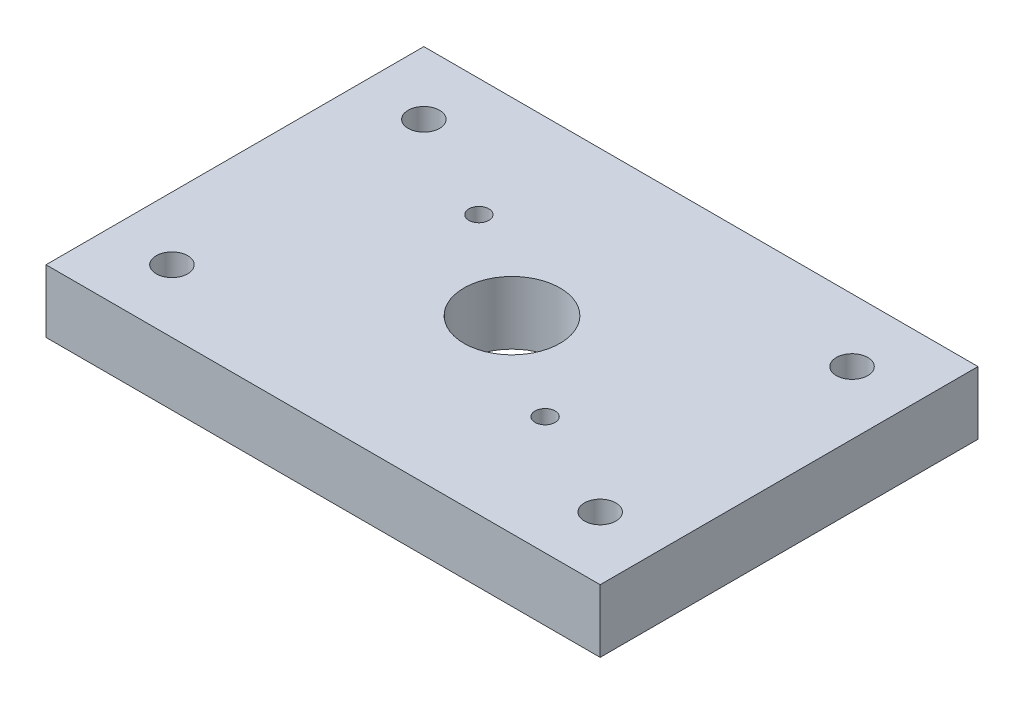
ISO-10303-21;
HEADER;
FILE_DESCRIPTION(('STEP AP214'),'2;1');
FILE_NAME('part.step','',(''),(''),'','','');
FILE_SCHEMA(('AUTOMOTIVE_DESIGN { 1 0 10303 214 1 1 1 1 }'));
ENDSEC;
DATA;
#1=APPLICATION_CONTEXT('core data for automotive mechanical design processes');
#2=APPLICATION_PROTOCOL_DEFINITION('international standard','automotive_design',2000,#1);
#3=PRODUCT_CONTEXT('',#1,'mechanical');
#4=PRODUCT('Part','Part','',(#3));
#5=PRODUCT_RELATED_PRODUCT_CATEGORY('part','',(#4));
#6=PRODUCT_DEFINITION_FORMATION('','',#4);
#7=PRODUCT_DEFINITION_CONTEXT('part definition',#1,'design');
#8=PRODUCT_DEFINITION('design','',#6,#7);
#9=PRODUCT_DEFINITION_SHAPE('','',#8);
#10=(LENGTH_UNIT() NAMED_UNIT(*) SI_UNIT(.MILLI.,.METRE.));
#11=(NAMED_UNIT(*) PLANE_ANGLE_UNIT() SI_UNIT($,.RADIAN.));
#12=(NAMED_UNIT(*) SI_UNIT($,.STERADIAN.) SOLID_ANGLE_UNIT());
#13=UNCERTAINTY_MEASURE_WITH_UNIT(LENGTH_MEASURE(1.E-05),#10,'distance_accuracy_value','');
#14=(GEOMETRIC_REPRESENTATION_CONTEXT(3) GLOBAL_UNCERTAINTY_ASSIGNED_CONTEXT((#13)) GLOBAL_UNIT_ASSIGNED_CONTEXT((#10,
#11,#12)) REPRESENTATION_CONTEXT('',''));
#15=CARTESIAN_POINT('',(0.,0.,0.));
#16=DIRECTION('',(0.,0.,1.));
#17=DIRECTION('',(1.,0.,0.));
#18=AXIS2_PLACEMENT_3D('',#15,#16,#17);
#19=CARTESIAN_POINT('',(0.,12.7,0.));
#20=DIRECTION('',(0.,1.,0.));
#21=DIRECTION('',(0.,0.,1.));
#22=AXIS2_PLACEMENT_3D('',#19,#20,#21);
#23=PLANE('',#22);
#24=CARTESIAN_POINT('',(43.18,12.7,25.4));
#25=DIRECTION('',(0.,1.,0.));
#26=DIRECTION('',(0.,0.,1.));
#27=AXIS2_PLACEMENT_3D('',#24,#25,#26);
#28=CIRCLE('',#27,3.175);
#29=CARTESIAN_POINT('',(43.18,12.7,28.575));
#30=VERTEX_POINT('',#29);
#31=EDGE_CURVE('E138',#30,#30,#28,.T.);
#32=ORIENTED_EDGE('',*,*,#31,.F.);
#33=EDGE_LOOP('',(#32));
#34=FACE_BOUND('',#33,.T.);
#35=CARTESIAN_POINT('',(-43.18,12.7,-25.4));
#36=DIRECTION('',(0.,1.,0.));
#37=DIRECTION('',(0.,0.,1.));
#38=AXIS2_PLACEMENT_3D('',#35,#36,#37);
#39=CIRCLE('',#38,3.175);
#40=CARTESIAN_POINT('',(-43.18,12.7,-22.225));
#41=VERTEX_POINT('',#40);
#42=EDGE_CURVE('E126',#41,#41,#39,.T.);
#43=ORIENTED_EDGE('',*,*,#42,.F.);
#44=EDGE_LOOP('',(#43));
#45=FACE_BOUND('',#44,.T.);
#46=CARTESIAN_POINT('',(-20.9861745073117,12.7,-14.3087553458943));
#47=DIRECTION('',(0.,1.,0.));
#48=DIRECTION('',(0.,0.,1.));
#49=AXIS2_PLACEMENT_3D('',#46,#47,#48);
#50=CIRCLE('',#49,2.0193);
#51=CARTESIAN_POINT('',(-20.9861745073117,12.7,-12.2894553458943));
#52=VERTEX_POINT('',#51);
#53=EDGE_CURVE('E114',#52,#52,#50,.T.);
#54=ORIENTED_EDGE('',*,*,#53,.F.);
#55=EDGE_LOOP('',(#54));
#56=FACE_BOUND('',#55,.T.);
#57=DIRECTION('',(0.,0.,1.));
#58=VECTOR('',#57,1.);
#59=CARTESIAN_POINT('',(-55.88,12.7,38.1));
#60=LINE('',#59,#58);
#61=CARTESIAN_POINT('',(-55.88,12.7,-38.1));
#62=VERTEX_POINT('',#61);
#63=CARTESIAN_POINT('',(-55.88,12.7,38.1));
#64=VERTEX_POINT('',#63);
#65=EDGE_CURVE('E84',#62,#64,#60,.T.);
#66=ORIENTED_EDGE('',*,*,#65,.T.);
#67=DIRECTION('',(1.,0.,0.));
#68=VECTOR('',#67,1.);
#69=CARTESIAN_POINT('',(55.88,12.7,38.1));
#70=LINE('',#69,#68);
#71=CARTESIAN_POINT('',(55.88,12.7,38.1));
#72=VERTEX_POINT('',#71);
#73=EDGE_CURVE('E79',#64,#72,#70,.T.);
#74=ORIENTED_EDGE('',*,*,#73,.T.);
#75=DIRECTION('',(0.,0.,-1.));
#76=VECTOR('',#75,1.);
#77=CARTESIAN_POINT('',(55.88,12.7,38.1));
#78=LINE('',#77,#76);
#79=CARTESIAN_POINT('',(55.88,12.7,-38.1));
#80=VERTEX_POINT('',#79);
#81=EDGE_CURVE('E82',#72,#80,#78,.T.);
#82=ORIENTED_EDGE('',*,*,#81,.T.);
#83=DIRECTION('',(-1.,0.,0.));
#84=VECTOR('',#83,1.);
#85=CARTESIAN_POINT('',(55.88,12.7,-38.1));
#86=LINE('',#85,#84);
#87=EDGE_CURVE('E49',#80,#62,#86,.T.);
#88=ORIENTED_EDGE('',*,*,#87,.T.);
#89=EDGE_LOOP('',(#66,#74,#82,#88));
#90=FACE_BOUND('',#89,.T.);
#91=CARTESIAN_POINT('',(0.,12.7,0.));
#92=DIRECTION('',(0.,1.,0.));
#93=DIRECTION('',(0.,0.,1.));
#94=AXIS2_PLACEMENT_3D('',#91,#92,#93);
#95=CIRCLE('',#94,9.68375);
#96=CARTESIAN_POINT('',(0.,12.7,9.68375));
#97=VERTEX_POINT('',#96);
#98=EDGE_CURVE('E99',#97,#97,#95,.T.);
#99=ORIENTED_EDGE('',*,*,#98,.F.);
#100=EDGE_LOOP('',(#99));
#101=FACE_BOUND('',#100,.T.);
#102=CARTESIAN_POINT('',(20.9861745073117,12.7,14.3087553458944));
#103=DIRECTION('',(0.,1.,0.));
#104=DIRECTION('',(0.,0.,1.));
#105=AXIS2_PLACEMENT_3D('',#102,#103,#104);
#106=CIRCLE('',#105,2.0193);
#107=CARTESIAN_POINT('',(20.9861745073117,12.7,16.3280553458943));
#108=VERTEX_POINT('',#107);
#109=EDGE_CURVE('E120',#108,#108,#106,.T.);
#110=ORIENTED_EDGE('',*,*,#109,.F.);
#111=EDGE_LOOP('',(#110));
#112=FACE_BOUND('',#111,.T.);
#113=CARTESIAN_POINT('',(-43.18,12.7,25.4));
#114=DIRECTION('',(0.,1.,0.));
#115=DIRECTION('',(0.,0.,1.));
#116=AXIS2_PLACEMENT_3D('',#113,#114,#115);
#117=CIRCLE('',#116,3.175);
#118=CARTESIAN_POINT('',(-43.18,12.7,28.575));
#119=VERTEX_POINT('',#118);
#120=EDGE_CURVE('E132',#119,#119,#117,.T.);
#121=ORIENTED_EDGE('',*,*,#120,.F.);
#122=EDGE_LOOP('',(#121));
#123=FACE_BOUND('',#122,.T.);
#124=CARTESIAN_POINT('',(43.18,12.7,-25.4));
#125=DIRECTION('',(0.,1.,0.));
#126=DIRECTION('',(0.,0.,1.));
#127=AXIS2_PLACEMENT_3D('',#124,#125,#126);
#128=CIRCLE('',#127,3.175);
#129=CARTESIAN_POINT('',(43.18,12.7,-22.225));
#130=VERTEX_POINT('',#129);
#131=EDGE_CURVE('E144',#130,#130,#128,.T.);
#132=ORIENTED_EDGE('',*,*,#131,.F.);
#133=EDGE_LOOP('',(#132));
#134=FACE_BOUND('',#133,.T.);
#135=ADVANCED_FACE('F32',(#34,#45,#56,#90,#101,#112,#123,#134),#23,.T.);
#136=CARTESIAN_POINT('',(0.,0.,0.));
#137=DIRECTION('',(0.,1.,0.));
#138=DIRECTION('',(0.,0.,1.));
#139=AXIS2_PLACEMENT_3D('',#136,#137,#138);
#140=PLANE('',#139);
#141=DIRECTION('',(0.,0.,1.));
#142=VECTOR('',#141,1.);
#143=CARTESIAN_POINT('',(-55.88,0.,38.1));
#144=LINE('',#143,#142);
#145=CARTESIAN_POINT('',(-55.88,0.,-38.1));
#146=VERTEX_POINT('',#145);
#147=CARTESIAN_POINT('',(-55.88,0.,38.1));
#148=VERTEX_POINT('',#147);
#149=EDGE_CURVE('E96',#146,#148,#144,.T.);
#150=ORIENTED_EDGE('',*,*,#149,.F.);
#151=DIRECTION('',(-1.,0.,0.));
#152=VECTOR('',#151,1.);
#153=CARTESIAN_POINT('',(55.88,0.,-38.1));
#154=LINE('',#153,#152);
#155=CARTESIAN_POINT('',(55.88,0.,-38.1));
#156=VERTEX_POINT('',#155);
#157=EDGE_CURVE('E72',#156,#146,#154,.T.);
#158=ORIENTED_EDGE('',*,*,#157,.F.);
#159=DIRECTION('',(0.,0.,-1.));
#160=VECTOR('',#159,1.);
#161=CARTESIAN_POINT('',(55.88,0.,38.1));
#162=LINE('',#161,#160);
#163=CARTESIAN_POINT('',(55.88,0.,38.1));
#164=VERTEX_POINT('',#163);
#165=EDGE_CURVE('E66',#164,#156,#162,.T.);
#166=ORIENTED_EDGE('',*,*,#165,.F.);
#167=DIRECTION('',(1.,0.,0.));
#168=VECTOR('',#167,1.);
#169=CARTESIAN_POINT('',(55.88,0.,38.1));
#170=LINE('',#169,#168);
#171=EDGE_CURVE('E88',#148,#164,#170,.T.);
#172=ORIENTED_EDGE('',*,*,#171,.F.);
#173=EDGE_LOOP('',(#150,#158,#166,#172));
#174=FACE_BOUND('',#173,.T.);
#175=CARTESIAN_POINT('',(0.,0.,0.));
#176=DIRECTION('',(0.,1.,0.));
#177=DIRECTION('',(0.,0.,1.));
#178=AXIS2_PLACEMENT_3D('',#175,#176,#177);
#179=CIRCLE('',#178,9.68375);
#180=CARTESIAN_POINT('',(0.,0.,9.68375));
#181=VERTEX_POINT('',#180);
#182=EDGE_CURVE('E111',#181,#181,#179,.T.);
#183=ORIENTED_EDGE('',*,*,#182,.T.);
#184=EDGE_LOOP('',(#183));
#185=FACE_BOUND('',#184,.T.);
#186=CARTESIAN_POINT('',(-20.9861745073117,0.,-14.3087553458943));
#187=DIRECTION('',(0.,1.,0.));
#188=DIRECTION('',(0.,0.,1.));
#189=AXIS2_PLACEMENT_3D('',#186,#187,#188);
#190=CIRCLE('',#189,2.0193);
#191=CARTESIAN_POINT('',(-20.9861745073117,0.,-12.2894553458943));
#192=VERTEX_POINT('',#191);
#193=EDGE_CURVE('E117',#192,#192,#190,.T.);
#194=ORIENTED_EDGE('',*,*,#193,.T.);
#195=EDGE_LOOP('',(#194));
#196=FACE_BOUND('',#195,.T.);
#197=CARTESIAN_POINT('',(20.9861745073117,0.,14.3087553458944));
#198=DIRECTION('',(0.,1.,0.));
#199=DIRECTION('',(0.,0.,1.));
#200=AXIS2_PLACEMENT_3D('',#197,#198,#199);
#201=CIRCLE('',#200,2.0193);
#202=CARTESIAN_POINT('',(20.9861745073117,0.,16.3280553458943));
#203=VERTEX_POINT('',#202);
#204=EDGE_CURVE('E123',#203,#203,#201,.T.);
#205=ORIENTED_EDGE('',*,*,#204,.T.);
#206=EDGE_LOOP('',(#205));
#207=FACE_BOUND('',#206,.T.);
#208=CARTESIAN_POINT('',(-43.18,0.,-25.4));
#209=DIRECTION('',(0.,1.,0.));
#210=DIRECTION('',(0.,0.,1.));
#211=AXIS2_PLACEMENT_3D('',#208,#209,#210);
#212=CIRCLE('',#211,3.175);
#213=CARTESIAN_POINT('',(-43.18,0.,-22.225));
#214=VERTEX_POINT('',#213);
#215=EDGE_CURVE('E129',#214,#214,#212,.T.);
#216=ORIENTED_EDGE('',*,*,#215,.T.);
#217=EDGE_LOOP('',(#216));
#218=FACE_BOUND('',#217,.T.);
#219=CARTESIAN_POINT('',(-43.18,0.,25.4));
#220=DIRECTION('',(0.,1.,0.));
#221=DIRECTION('',(0.,0.,1.));
#222=AXIS2_PLACEMENT_3D('',#219,#220,#221);
#223=CIRCLE('',#222,3.175);
#224=CARTESIAN_POINT('',(-43.18,0.,28.575));
#225=VERTEX_POINT('',#224);
#226=EDGE_CURVE('E135',#225,#225,#223,.T.);
#227=ORIENTED_EDGE('',*,*,#226,.T.);
#228=EDGE_LOOP('',(#227));
#229=FACE_BOUND('',#228,.T.);
#230=CARTESIAN_POINT('',(43.18,0.,25.4));
#231=DIRECTION('',(0.,1.,0.));
#232=DIRECTION('',(0.,0.,1.));
#233=AXIS2_PLACEMENT_3D('',#230,#231,#232);
#234=CIRCLE('',#233,3.175);
#235=CARTESIAN_POINT('',(43.18,0.,28.575));
#236=VERTEX_POINT('',#235);
#237=EDGE_CURVE('E141',#236,#236,#234,.T.);
#238=ORIENTED_EDGE('',*,*,#237,.T.);
#239=EDGE_LOOP('',(#238));
#240=FACE_BOUND('',#239,.T.);
#241=CARTESIAN_POINT('',(43.18,0.,-25.4));
#242=DIRECTION('',(0.,1.,0.));
#243=DIRECTION('',(0.,0.,1.));
#244=AXIS2_PLACEMENT_3D('',#241,#242,#243);
#245=CIRCLE('',#244,3.175);
#246=CARTESIAN_POINT('',(43.18,0.,-22.225));
#247=VERTEX_POINT('',#246);
#248=EDGE_CURVE('E147',#247,#247,#245,.T.);
#249=ORIENTED_EDGE('',*,*,#248,.T.);
#250=EDGE_LOOP('',(#249));
#251=FACE_BOUND('',#250,.T.);
#252=ADVANCED_FACE('F107',(#174,#185,#196,#207,#218,#229,#240,#251),#140,.F.);
#253=CARTESIAN_POINT('',(-55.88,12.7,38.1));
#254=DIRECTION('',(1.,0.,0.));
#255=DIRECTION('',(0.,0.,-1.));
#256=AXIS2_PLACEMENT_3D('',#253,#254,#255);
#257=PLANE('',#256);
#258=ORIENTED_EDGE('',*,*,#149,.T.);
#259=DIRECTION('',(0.,-1.,0.));
#260=VECTOR('',#259,1.);
#261=CARTESIAN_POINT('',(-55.88,12.7,38.1));
#262=LINE('',#261,#260);
#263=EDGE_CURVE('E11',#64,#148,#262,.T.);
#264=ORIENTED_EDGE('',*,*,#263,.F.);
#265=ORIENTED_EDGE('',*,*,#65,.F.);
#266=DIRECTION('',(0.,-1.,0.));
#267=VECTOR('',#266,1.);
#268=CARTESIAN_POINT('',(-55.88,12.7,-38.1));
#269=LINE('',#268,#267);
#270=EDGE_CURVE('E92',#62,#146,#269,.T.);
#271=ORIENTED_EDGE('',*,*,#270,.T.);
#272=EDGE_LOOP('',(#258,#264,#265,#271));
#273=FACE_BOUND('',#272,.T.);
#274=ADVANCED_FACE('F34',(#273),#257,.F.);
#275=CARTESIAN_POINT('',(55.88,12.7,38.1));
#276=DIRECTION('',(0.,0.,-1.));
#277=DIRECTION('',(-1.,0.,0.));
#278=AXIS2_PLACEMENT_3D('',#275,#276,#277);
#279=PLANE('',#278);
#280=ORIENTED_EDGE('',*,*,#171,.T.);
#281=DIRECTION('',(0.,-1.,0.));
#282=VECTOR('',#281,1.);
#283=CARTESIAN_POINT('',(55.88,12.7,38.1));
#284=LINE('',#283,#282);
#285=EDGE_CURVE('E41',#72,#164,#284,.T.);
#286=ORIENTED_EDGE('',*,*,#285,.F.);
#287=ORIENTED_EDGE('',*,*,#73,.F.);
#288=ORIENTED_EDGE('',*,*,#263,.T.);
#289=EDGE_LOOP('',(#280,#286,#287,#288));
#290=FACE_BOUND('',#289,.T.);
#291=ADVANCED_FACE('F87',(#290),#279,.F.);
#292=CARTESIAN_POINT('',(55.88,12.7,38.1));
#293=DIRECTION('',(-1.,0.,0.));
#294=DIRECTION('',(0.,0.,1.));
#295=AXIS2_PLACEMENT_3D('',#292,#293,#294);
#296=PLANE('',#295);
#297=ORIENTED_EDGE('',*,*,#165,.T.);
#298=DIRECTION('',(0.,-1.,0.));
#299=VECTOR('',#298,1.);
#300=CARTESIAN_POINT('',(55.88,12.7,-38.1));
#301=LINE('',#300,#299);
#302=EDGE_CURVE('E89',#80,#156,#301,.T.);
#303=ORIENTED_EDGE('',*,*,#302,.F.);
#304=ORIENTED_EDGE('',*,*,#81,.F.);
#305=ORIENTED_EDGE('',*,*,#285,.T.);
#306=EDGE_LOOP('',(#297,#303,#304,#305));
#307=FACE_BOUND('',#306,.T.);
#308=ADVANCED_FACE('F90',(#307),#296,.F.);
#309=CARTESIAN_POINT('',(55.88,12.7,-38.1));
#310=DIRECTION('',(0.,0.,1.));
#311=DIRECTION('',(1.,0.,0.));
#312=AXIS2_PLACEMENT_3D('',#309,#310,#311);
#313=PLANE('',#312);
#314=ORIENTED_EDGE('',*,*,#157,.T.);
#315=ORIENTED_EDGE('',*,*,#270,.F.);
#316=ORIENTED_EDGE('',*,*,#87,.F.);
#317=ORIENTED_EDGE('',*,*,#302,.T.);
#318=EDGE_LOOP('',(#314,#315,#316,#317));
#319=FACE_BOUND('',#318,.T.);
#320=ADVANCED_FACE('F104',(#319),#313,.F.);
#321=CARTESIAN_POINT('',(0.,12.7,0.));
#322=DIRECTION('',(0.,-1.,0.));
#323=DIRECTION('',(0.,0.,-1.));
#324=AXIS2_PLACEMENT_3D('',#321,#322,#323);
#325=CYLINDRICAL_SURFACE('',#324,9.68375);
#326=ORIENTED_EDGE('',*,*,#98,.T.);
#327=EDGE_LOOP('',(#326));
#328=FACE_BOUND('',#327,.T.);
#329=ORIENTED_EDGE('',*,*,#182,.F.);
#330=EDGE_LOOP('',(#329));
#331=FACE_BOUND('',#330,.T.);
#332=ADVANCED_FACE('F166',(#328,#331),#325,.F.);
#333=CARTESIAN_POINT('',(-20.9861745073117,12.7,-14.3087553458943));
#334=DIRECTION('',(0.,-1.,0.));
#335=DIRECTION('',(0.,0.,-1.));
#336=AXIS2_PLACEMENT_3D('',#333,#334,#335);
#337=CYLINDRICAL_SURFACE('',#336,2.0193);
#338=ORIENTED_EDGE('',*,*,#53,.T.);
#339=EDGE_LOOP('',(#338));
#340=FACE_BOUND('',#339,.T.);
#341=ORIENTED_EDGE('',*,*,#193,.F.);
#342=EDGE_LOOP('',(#341));
#343=FACE_BOUND('',#342,.T.);
#344=ADVANCED_FACE('F212',(#340,#343),#337,.F.);
#345=CARTESIAN_POINT('',(20.9861745073117,12.7,14.3087553458944));
#346=DIRECTION('',(0.,-1.,0.));
#347=DIRECTION('',(0.,0.,-1.));
#348=AXIS2_PLACEMENT_3D('',#345,#346,#347);
#349=CYLINDRICAL_SURFACE('',#348,2.0193);
#350=ORIENTED_EDGE('',*,*,#109,.T.);
#351=EDGE_LOOP('',(#350));
#352=FACE_BOUND('',#351,.T.);
#353=ORIENTED_EDGE('',*,*,#204,.F.);
#354=EDGE_LOOP('',(#353));
#355=FACE_BOUND('',#354,.T.);
#356=ADVANCED_FACE('F220',(#352,#355),#349,.F.);
#357=CARTESIAN_POINT('',(-43.18,12.7,-25.4));
#358=DIRECTION('',(0.,-1.,0.));
#359=DIRECTION('',(0.,0.,-1.));
#360=AXIS2_PLACEMENT_3D('',#357,#358,#359);
#361=CYLINDRICAL_SURFACE('',#360,3.175);
#362=ORIENTED_EDGE('',*,*,#42,.T.);
#363=EDGE_LOOP('',(#362));
#364=FACE_BOUND('',#363,.T.);
#365=ORIENTED_EDGE('',*,*,#215,.F.);
#366=EDGE_LOOP('',(#365));
#367=FACE_BOUND('',#366,.T.);
#368=ADVANCED_FACE('F228',(#364,#367),#361,.F.);
#369=CARTESIAN_POINT('',(-43.18,12.7,25.4));
#370=DIRECTION('',(0.,-1.,0.));
#371=DIRECTION('',(0.,0.,-1.));
#372=AXIS2_PLACEMENT_3D('',#369,#370,#371);
#373=CYLINDRICAL_SURFACE('',#372,3.175);
#374=ORIENTED_EDGE('',*,*,#120,.T.);
#375=EDGE_LOOP('',(#374));
#376=FACE_BOUND('',#375,.T.);
#377=ORIENTED_EDGE('',*,*,#226,.F.);
#378=EDGE_LOOP('',(#377));
#379=FACE_BOUND('',#378,.T.);
#380=ADVANCED_FACE('F237',(#376,#379),#373,.F.);
#381=CARTESIAN_POINT('',(43.18,12.7,25.4));
#382=DIRECTION('',(0.,-1.,0.));
#383=DIRECTION('',(0.,0.,-1.));
#384=AXIS2_PLACEMENT_3D('',#381,#382,#383);
#385=CYLINDRICAL_SURFACE('',#384,3.175);
#386=ORIENTED_EDGE('',*,*,#31,.T.);
#387=EDGE_LOOP('',(#386));
#388=FACE_BOUND('',#387,.T.);
#389=ORIENTED_EDGE('',*,*,#237,.F.);
#390=EDGE_LOOP('',(#389));
#391=FACE_BOUND('',#390,.T.);
#392=ADVANCED_FACE('F246',(#388,#391),#385,.F.);
#393=CARTESIAN_POINT('',(43.18,12.7,-25.4));
#394=DIRECTION('',(0.,-1.,0.));
#395=DIRECTION('',(0.,0.,-1.));
#396=AXIS2_PLACEMENT_3D('',#393,#394,#395);
#397=CYLINDRICAL_SURFACE('',#396,3.175);
#398=ORIENTED_EDGE('',*,*,#131,.T.);
#399=EDGE_LOOP('',(#398));
#400=FACE_BOUND('',#399,.T.);
#401=ORIENTED_EDGE('',*,*,#248,.F.);
#402=EDGE_LOOP('',(#401));
#403=FACE_BOUND('',#402,.T.);
#404=ADVANCED_FACE('F153',(#400,#403),#397,.F.);
#405=CLOSED_SHELL('',(#135,#252,#274,#291,#308,#320,#332,#344,#356,#368,#380,#392,#404));
#406=MANIFOLD_SOLID_BREP('B2',#405);
#407=ADVANCED_BREP_SHAPE_REPRESENTATION('',(#18,#406),#14);
#408=SHAPE_DEFINITION_REPRESENTATION(#9,#407);
ENDSEC;
END-ISO-10303-21;
